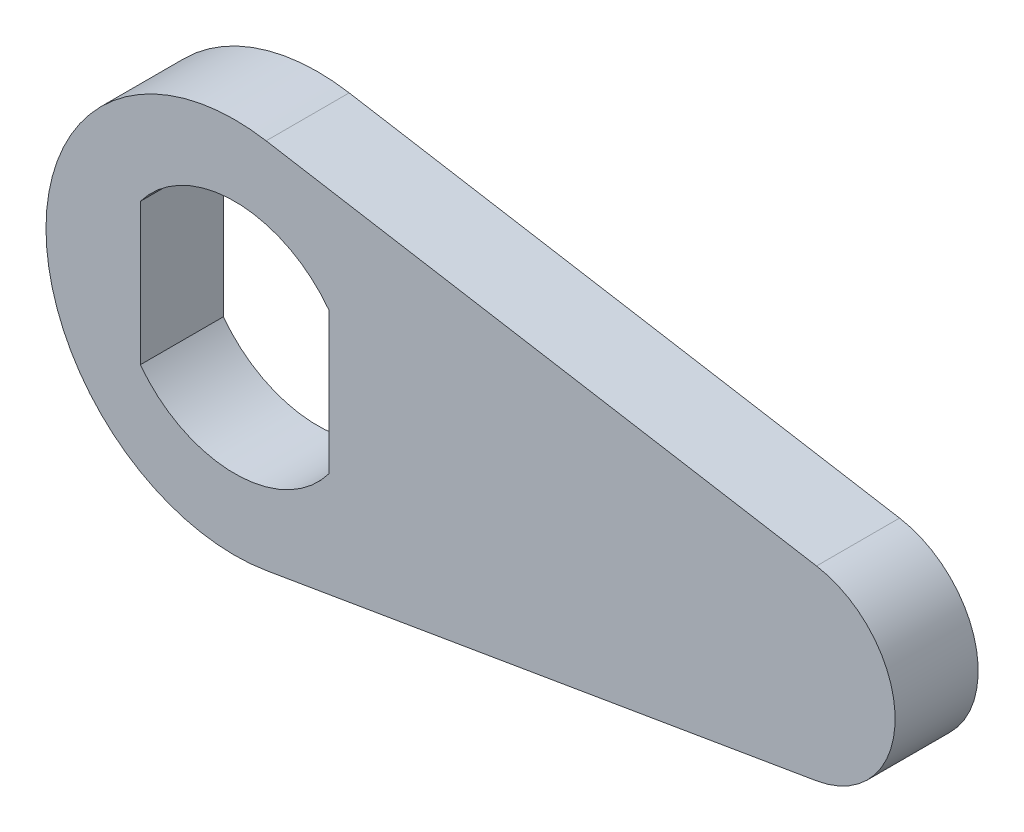
ISO-10303-21;
HEADER;
FILE_DESCRIPTION(('STEP AP214'),'2;1');
FILE_NAME('part.step','',(''),(''),'','','');
FILE_SCHEMA(('AUTOMOTIVE_DESIGN { 1 0 10303 214 1 1 1 1 }'));
ENDSEC;
DATA;
#1=APPLICATION_CONTEXT('core data for automotive mechanical design processes');
#2=APPLICATION_PROTOCOL_DEFINITION('international standard','automotive_design',2000,#1);
#3=PRODUCT_CONTEXT('',#1,'mechanical');
#4=PRODUCT('Part','Part','',(#3));
#5=PRODUCT_RELATED_PRODUCT_CATEGORY('part','',(#4));
#6=PRODUCT_DEFINITION_FORMATION('','',#4);
#7=PRODUCT_DEFINITION_CONTEXT('part definition',#1,'design');
#8=PRODUCT_DEFINITION('design','',#6,#7);
#9=PRODUCT_DEFINITION_SHAPE('','',#8);
#10=(LENGTH_UNIT() NAMED_UNIT(*) SI_UNIT(.MILLI.,.METRE.));
#11=(NAMED_UNIT(*) PLANE_ANGLE_UNIT() SI_UNIT($,.RADIAN.));
#12=(NAMED_UNIT(*) SI_UNIT($,.STERADIAN.) SOLID_ANGLE_UNIT());
#13=UNCERTAINTY_MEASURE_WITH_UNIT(LENGTH_MEASURE(1.E-05),#10,'distance_accuracy_value','');
#14=(GEOMETRIC_REPRESENTATION_CONTEXT(3) GLOBAL_UNCERTAINTY_ASSIGNED_CONTEXT((#13)) GLOBAL_UNIT_ASSIGNED_CONTEXT((#10,
#11,#12)) REPRESENTATION_CONTEXT('',''));
#15=CARTESIAN_POINT('',(0.,0.,0.));
#16=DIRECTION('',(0.,0.,1.));
#17=DIRECTION('',(1.,0.,0.));
#18=AXIS2_PLACEMENT_3D('',#15,#16,#17);
#19=CARTESIAN_POINT('',(0.,0.,2.794));
#20=DIRECTION('',(0.,0.,1.));
#21=DIRECTION('',(1.,0.,0.));
#22=AXIS2_PLACEMENT_3D('',#19,#20,#21);
#23=PLANE('',#22);
#24=CARTESIAN_POINT('',(0.,0.,2.794));
#25=DIRECTION('',(0.,0.,1.));
#26=DIRECTION('',(1.,0.,0.));
#27=AXIS2_PLACEMENT_3D('',#24,#25,#26);
#28=CIRCLE('',#27,6.35);
#29=CARTESIAN_POINT('',(1.05833333333333,6.26118443711376,2.794));
#30=VERTEX_POINT('',#29);
#31=CARTESIAN_POINT('',(1.05833333333333,-6.26118443711376,2.794));
#32=VERTEX_POINT('',#31);
#33=EDGE_CURVE('E134',#30,#32,#28,.T.);
#34=ORIENTED_EDGE('',*,*,#33,.T.);
#35=DIRECTION('',(0.986013297183269,0.166666666666667,0.));
#36=VECTOR('',#35,1.);
#37=CARTESIAN_POINT('',(19.5791666666667,-3.13059221855688,2.794));
#38=LINE('',#37,#36);
#39=CARTESIAN_POINT('',(19.5791666666667,-3.13059221855688,2.794));
#40=VERTEX_POINT('',#39);
#41=EDGE_CURVE('E137',#32,#40,#38,.T.);
#42=ORIENTED_EDGE('',*,*,#41,.T.);
#43=CARTESIAN_POINT('',(19.05,0.,2.794));
#44=DIRECTION('',(0.,0.,1.));
#45=DIRECTION('',(-1.,0.,0.));
#46=AXIS2_PLACEMENT_3D('',#43,#44,#45);
#47=CIRCLE('',#46,3.175);
#48=CARTESIAN_POINT('',(19.5791666666667,3.13059221855688,2.794));
#49=VERTEX_POINT('',#48);
#50=EDGE_CURVE('E140',#40,#49,#47,.T.);
#51=ORIENTED_EDGE('',*,*,#50,.T.);
#52=DIRECTION('',(-0.986013297183269,0.166666666666667,0.));
#53=VECTOR('',#52,1.);
#54=CARTESIAN_POINT('',(1.05833333333333,6.26118443711376,2.794));
#55=LINE('',#54,#53);
#56=EDGE_CURVE('E142',#49,#30,#55,.T.);
#57=ORIENTED_EDGE('',*,*,#56,.T.);
#58=EDGE_LOOP('',(#34,#42,#51,#57));
#59=FACE_BOUND('',#58,.T.);
#60=DIRECTION('',(0.,1.,0.));
#61=VECTOR('',#60,1.);
#62=CARTESIAN_POINT('',(3.175,2.38125,2.794));
#63=LINE('',#62,#61);
#64=CARTESIAN_POINT('',(3.175,-2.38125,2.794));
#65=VERTEX_POINT('',#64);
#66=CARTESIAN_POINT('',(3.175,2.38125,2.794));
#67=VERTEX_POINT('',#66);
#68=EDGE_CURVE('E106',#65,#67,#63,.T.);
#69=ORIENTED_EDGE('',*,*,#68,.F.);
#70=CARTESIAN_POINT('',(0.,0.,2.794));
#71=DIRECTION('',(0.,0.,1.));
#72=DIRECTION('',(1.,0.,0.));
#73=AXIS2_PLACEMENT_3D('',#70,#71,#72);
#74=CIRCLE('',#73,3.96875);
#75=CARTESIAN_POINT('',(-3.175,-2.38125,2.794));
#76=VERTEX_POINT('',#75);
#77=EDGE_CURVE('E98',#76,#65,#74,.T.);
#78=ORIENTED_EDGE('',*,*,#77,.F.);
#79=DIRECTION('',(0.,-1.,0.));
#80=VECTOR('',#79,1.);
#81=CARTESIAN_POINT('',(-3.175,2.38125,2.794));
#82=LINE('',#81,#80);
#83=CARTESIAN_POINT('',(-3.175,2.38125,2.794));
#84=VERTEX_POINT('',#83);
#85=EDGE_CURVE('E120',#84,#76,#82,.T.);
#86=ORIENTED_EDGE('',*,*,#85,.F.);
#87=CARTESIAN_POINT('',(0.,0.,2.794));
#88=DIRECTION('',(0.,0.,1.));
#89=DIRECTION('',(1.,0.,0.));
#90=AXIS2_PLACEMENT_3D('',#87,#88,#89);
#91=CIRCLE('',#90,3.96875);
#92=EDGE_CURVE('E118',#67,#84,#91,.T.);
#93=ORIENTED_EDGE('',*,*,#92,.F.);
#94=EDGE_LOOP('',(#69,#78,#86,#93));
#95=FACE_BOUND('',#94,.T.);
#96=ADVANCED_FACE('F33',(#59,#95),#23,.T.);
#97=CARTESIAN_POINT('',(0.,0.,0.));
#98=DIRECTION('',(0.,0.,1.));
#99=DIRECTION('',(1.,0.,0.));
#100=AXIS2_PLACEMENT_3D('',#97,#98,#99);
#101=PLANE('',#100);
#102=CARTESIAN_POINT('',(0.,0.,0.));
#103=DIRECTION('',(0.,0.,1.));
#104=DIRECTION('',(1.,0.,0.));
#105=AXIS2_PLACEMENT_3D('',#102,#103,#104);
#106=CIRCLE('',#105,6.35);
#107=CARTESIAN_POINT('',(1.05833333333333,6.26118443711376,0.));
#108=VERTEX_POINT('',#107);
#109=CARTESIAN_POINT('',(1.05833333333333,-6.26118443711376,0.));
#110=VERTEX_POINT('',#109);
#111=EDGE_CURVE('E114',#108,#110,#106,.T.);
#112=ORIENTED_EDGE('',*,*,#111,.F.);
#113=DIRECTION('',(-0.986013297183269,0.166666666666667,0.));
#114=VECTOR('',#113,1.);
#115=CARTESIAN_POINT('',(1.05833333333333,6.26118443711376,0.));
#116=LINE('',#115,#114);
#117=CARTESIAN_POINT('',(19.5791666666667,3.13059221855688,0.));
#118=VERTEX_POINT('',#117);
#119=EDGE_CURVE('E138',#118,#108,#116,.T.);
#120=ORIENTED_EDGE('',*,*,#119,.F.);
#121=CARTESIAN_POINT('',(19.05,0.,0.));
#122=DIRECTION('',(0.,0.,1.));
#123=DIRECTION('',(-1.,0.,0.));
#124=AXIS2_PLACEMENT_3D('',#121,#122,#123);
#125=CIRCLE('',#124,3.175);
#126=CARTESIAN_POINT('',(19.5791666666667,-3.13059221855688,0.));
#127=VERTEX_POINT('',#126);
#128=EDGE_CURVE('E149',#127,#118,#125,.T.);
#129=ORIENTED_EDGE('',*,*,#128,.F.);
#130=DIRECTION('',(0.986013297183269,0.166666666666667,0.));
#131=VECTOR('',#130,1.);
#132=CARTESIAN_POINT('',(19.5791666666667,-3.13059221855688,0.));
#133=LINE('',#132,#131);
#134=EDGE_CURVE('E147',#110,#127,#133,.T.);
#135=ORIENTED_EDGE('',*,*,#134,.F.);
#136=EDGE_LOOP('',(#112,#120,#129,#135));
#137=FACE_BOUND('',#136,.T.);
#138=CARTESIAN_POINT('',(0.,0.,0.));
#139=DIRECTION('',(0.,0.,1.));
#140=DIRECTION('',(1.,0.,0.));
#141=AXIS2_PLACEMENT_3D('',#138,#139,#140);
#142=CIRCLE('',#141,3.96875);
#143=CARTESIAN_POINT('',(-3.175,-2.38125,0.));
#144=VERTEX_POINT('',#143);
#145=CARTESIAN_POINT('',(3.175,-2.38125,0.));
#146=VERTEX_POINT('',#145);
#147=EDGE_CURVE('E56',#144,#146,#142,.T.);
#148=ORIENTED_EDGE('',*,*,#147,.T.);
#149=DIRECTION('',(0.,1.,0.));
#150=VECTOR('',#149,1.);
#151=CARTESIAN_POINT('',(3.175,2.38125,0.));
#152=LINE('',#151,#150);
#153=CARTESIAN_POINT('',(3.175,2.38125,0.));
#154=VERTEX_POINT('',#153);
#155=EDGE_CURVE('E113',#146,#154,#152,.T.);
#156=ORIENTED_EDGE('',*,*,#155,.T.);
#157=CARTESIAN_POINT('',(0.,0.,0.));
#158=DIRECTION('',(0.,0.,1.));
#159=DIRECTION('',(1.,0.,0.));
#160=AXIS2_PLACEMENT_3D('',#157,#158,#159);
#161=CIRCLE('',#160,3.96875);
#162=CARTESIAN_POINT('',(-3.175,2.38125,0.));
#163=VERTEX_POINT('',#162);
#164=EDGE_CURVE('E126',#154,#163,#161,.T.);
#165=ORIENTED_EDGE('',*,*,#164,.T.);
#166=DIRECTION('',(0.,-1.,0.));
#167=VECTOR('',#166,1.);
#168=CARTESIAN_POINT('',(-3.175,2.38125,0.));
#169=LINE('',#168,#167);
#170=EDGE_CURVE('E107',#163,#144,#169,.T.);
#171=ORIENTED_EDGE('',*,*,#170,.T.);
#172=EDGE_LOOP('',(#148,#156,#165,#171));
#173=FACE_BOUND('',#172,.T.);
#174=ADVANCED_FACE('F167',(#137,#173),#101,.F.);
#175=CARTESIAN_POINT('',(0.,0.,2.794));
#176=DIRECTION('',(0.,0.,-1.));
#177=DIRECTION('',(-1.,0.,0.));
#178=AXIS2_PLACEMENT_3D('',#175,#176,#177);
#179=CYLINDRICAL_SURFACE('',#178,6.35);
#180=ORIENTED_EDGE('',*,*,#111,.T.);
#181=DIRECTION('',(0.,0.,-1.));
#182=VECTOR('',#181,1.);
#183=CARTESIAN_POINT('',(1.05833333333333,-6.26118443711376,2.794));
#184=LINE('',#183,#182);
#185=EDGE_CURVE('E11',#32,#110,#184,.T.);
#186=ORIENTED_EDGE('',*,*,#185,.F.);
#187=ORIENTED_EDGE('',*,*,#33,.F.);
#188=DIRECTION('',(0.,0.,-1.));
#189=VECTOR('',#188,1.);
#190=CARTESIAN_POINT('',(1.05833333333333,6.26118443711376,2.794));
#191=LINE('',#190,#189);
#192=EDGE_CURVE('E144',#30,#108,#191,.T.);
#193=ORIENTED_EDGE('',*,*,#192,.T.);
#194=EDGE_LOOP('',(#180,#186,#187,#193));
#195=FACE_BOUND('',#194,.T.);
#196=ADVANCED_FACE('F35',(#195),#179,.T.);
#197=CARTESIAN_POINT('',(19.5791666666667,-3.13059221855688,2.794));
#198=DIRECTION('',(-0.166666666666667,0.986013297183269,0.));
#199=DIRECTION('',(-0.986013297183269,-0.166666666666667,0.));
#200=AXIS2_PLACEMENT_3D('',#197,#198,#199);
#201=PLANE('',#200);
#202=ORIENTED_EDGE('',*,*,#134,.T.);
#203=DIRECTION('',(0.,0.,-1.));
#204=VECTOR('',#203,1.);
#205=CARTESIAN_POINT('',(19.5791666666667,-3.13059221855688,2.794));
#206=LINE('',#205,#204);
#207=EDGE_CURVE('E41',#40,#127,#206,.T.);
#208=ORIENTED_EDGE('',*,*,#207,.F.);
#209=ORIENTED_EDGE('',*,*,#41,.F.);
#210=ORIENTED_EDGE('',*,*,#185,.T.);
#211=EDGE_LOOP('',(#202,#208,#209,#210));
#212=FACE_BOUND('',#211,.T.);
#213=ADVANCED_FACE('F177',(#212),#201,.F.);
#214=CARTESIAN_POINT('',(19.05,0.,2.794));
#215=DIRECTION('',(0.,0.,-1.));
#216=DIRECTION('',(-1.,0.,0.));
#217=AXIS2_PLACEMENT_3D('',#214,#215,#216);
#218=CYLINDRICAL_SURFACE('',#217,3.175);
#219=ORIENTED_EDGE('',*,*,#128,.T.);
#220=DIRECTION('',(0.,0.,-1.));
#221=VECTOR('',#220,1.);
#222=CARTESIAN_POINT('',(19.5791666666667,3.13059221855688,2.794));
#223=LINE('',#222,#221);
#224=EDGE_CURVE('E154',#49,#118,#223,.T.);
#225=ORIENTED_EDGE('',*,*,#224,.F.);
#226=ORIENTED_EDGE('',*,*,#50,.F.);
#227=ORIENTED_EDGE('',*,*,#207,.T.);
#228=EDGE_LOOP('',(#219,#225,#226,#227));
#229=FACE_BOUND('',#228,.T.);
#230=ADVANCED_FACE('F161',(#229),#218,.T.);
#231=CARTESIAN_POINT('',(1.05833333333333,6.26118443711376,2.794));
#232=DIRECTION('',(-0.166666666666667,-0.986013297183269,0.));
#233=DIRECTION('',(0.986013297183269,-0.166666666666667,0.));
#234=AXIS2_PLACEMENT_3D('',#231,#232,#233);
#235=PLANE('',#234);
#236=ORIENTED_EDGE('',*,*,#119,.T.);
#237=ORIENTED_EDGE('',*,*,#192,.F.);
#238=ORIENTED_EDGE('',*,*,#56,.F.);
#239=ORIENTED_EDGE('',*,*,#224,.T.);
#240=EDGE_LOOP('',(#236,#237,#238,#239));
#241=FACE_BOUND('',#240,.T.);
#242=ADVANCED_FACE('F171',(#241),#235,.F.);
#243=CARTESIAN_POINT('',(0.,0.,2.794));
#244=DIRECTION('',(0.,0.,-1.));
#245=DIRECTION('',(-1.,0.,0.));
#246=AXIS2_PLACEMENT_3D('',#243,#244,#245);
#247=CYLINDRICAL_SURFACE('',#246,3.96875);
#248=ORIENTED_EDGE('',*,*,#147,.F.);
#249=DIRECTION('',(0.,0.,-1.));
#250=VECTOR('',#249,1.);
#251=CARTESIAN_POINT('',(-3.175,-2.38125,2.794));
#252=LINE('',#251,#250);
#253=EDGE_CURVE('E102',#76,#144,#252,.T.);
#254=ORIENTED_EDGE('',*,*,#253,.F.);
#255=ORIENTED_EDGE('',*,*,#77,.T.);
#256=DIRECTION('',(0.,0.,-1.));
#257=VECTOR('',#256,1.);
#258=CARTESIAN_POINT('',(3.175,-2.38125,2.794));
#259=LINE('',#258,#257);
#260=EDGE_CURVE('E101',#65,#146,#259,.T.);
#261=ORIENTED_EDGE('',*,*,#260,.T.);
#262=EDGE_LOOP('',(#248,#254,#255,#261));
#263=FACE_BOUND('',#262,.T.);
#264=ADVANCED_FACE('F100',(#263),#247,.F.);
#265=CARTESIAN_POINT('',(3.175,2.38125,2.794));
#266=DIRECTION('',(-1.,0.,0.));
#267=DIRECTION('',(0.,0.,1.));
#268=AXIS2_PLACEMENT_3D('',#265,#266,#267);
#269=PLANE('',#268);
#270=ORIENTED_EDGE('',*,*,#155,.F.);
#271=ORIENTED_EDGE('',*,*,#260,.F.);
#272=ORIENTED_EDGE('',*,*,#68,.T.);
#273=DIRECTION('',(0.,0.,-1.));
#274=VECTOR('',#273,1.);
#275=CARTESIAN_POINT('',(3.175,2.38125,2.794));
#276=LINE('',#275,#274);
#277=EDGE_CURVE('E115',#67,#154,#276,.T.);
#278=ORIENTED_EDGE('',*,*,#277,.T.);
#279=EDGE_LOOP('',(#270,#271,#272,#278));
#280=FACE_BOUND('',#279,.T.);
#281=ADVANCED_FACE('F110',(#280),#269,.T.);
#282=CARTESIAN_POINT('',(0.,0.,2.794));
#283=DIRECTION('',(0.,0.,-1.));
#284=DIRECTION('',(-1.,0.,0.));
#285=AXIS2_PLACEMENT_3D('',#282,#283,#284);
#286=CYLINDRICAL_SURFACE('',#285,3.96875);
#287=ORIENTED_EDGE('',*,*,#164,.F.);
#288=ORIENTED_EDGE('',*,*,#277,.F.);
#289=ORIENTED_EDGE('',*,*,#92,.T.);
#290=DIRECTION('',(0.,0.,-1.));
#291=VECTOR('',#290,1.);
#292=CARTESIAN_POINT('',(-3.175,2.38125,2.794));
#293=LINE('',#292,#291);
#294=EDGE_CURVE('E48',#84,#163,#293,.T.);
#295=ORIENTED_EDGE('',*,*,#294,.T.);
#296=EDGE_LOOP('',(#287,#288,#289,#295));
#297=FACE_BOUND('',#296,.T.);
#298=ADVANCED_FACE('F200',(#297),#286,.F.);
#299=CARTESIAN_POINT('',(-3.175,2.38125,2.794));
#300=DIRECTION('',(1.,0.,0.));
#301=DIRECTION('',(0.,0.,-1.));
#302=AXIS2_PLACEMENT_3D('',#299,#300,#301);
#303=PLANE('',#302);
#304=ORIENTED_EDGE('',*,*,#170,.F.);
#305=ORIENTED_EDGE('',*,*,#294,.F.);
#306=ORIENTED_EDGE('',*,*,#85,.T.);
#307=ORIENTED_EDGE('',*,*,#253,.T.);
#308=EDGE_LOOP('',(#304,#305,#306,#307));
#309=FACE_BOUND('',#308,.T.);
#310=ADVANCED_FACE('F204',(#309),#303,.T.);
#311=CLOSED_SHELL('',(#96,#174,#196,#213,#230,#242,#264,#281,#298,#310));
#312=MANIFOLD_SOLID_BREP('B2',#311);
#313=ADVANCED_BREP_SHAPE_REPRESENTATION('',(#18,#312),#14);
#314=SHAPE_DEFINITION_REPRESENTATION(#9,#313);
ENDSEC;
END-ISO-10303-21;
